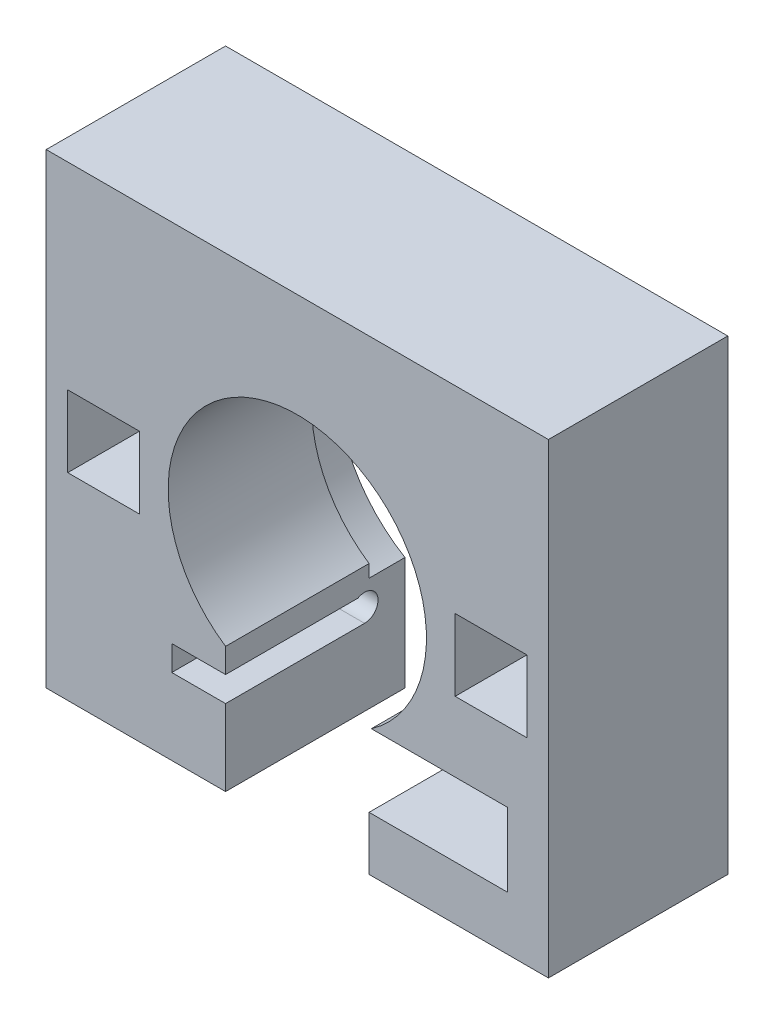
ISO-10303-21;
HEADER;
FILE_DESCRIPTION(('STEP AP214'),'2;1');
FILE_NAME('part.step','',(''),(''),'','','');
FILE_SCHEMA(('AUTOMOTIVE_DESIGN { 1 0 10303 214 1 1 1 1 }'));
ENDSEC;
DATA;
#1=APPLICATION_CONTEXT('core data for automotive mechanical design processes');
#2=APPLICATION_PROTOCOL_DEFINITION('international standard','automotive_design',2000,#1);
#3=PRODUCT_CONTEXT('',#1,'mechanical');
#4=PRODUCT('Part','Part','',(#3));
#5=PRODUCT_RELATED_PRODUCT_CATEGORY('part','',(#4));
#6=PRODUCT_DEFINITION_FORMATION('','',#4);
#7=PRODUCT_DEFINITION_CONTEXT('part definition',#1,'design');
#8=PRODUCT_DEFINITION('design','',#6,#7);
#9=PRODUCT_DEFINITION_SHAPE('','',#8);
#10=(LENGTH_UNIT() NAMED_UNIT(*) SI_UNIT(.MILLI.,.METRE.));
#11=(NAMED_UNIT(*) PLANE_ANGLE_UNIT() SI_UNIT($,.RADIAN.));
#12=(NAMED_UNIT(*) SI_UNIT($,.STERADIAN.) SOLID_ANGLE_UNIT());
#13=UNCERTAINTY_MEASURE_WITH_UNIT(LENGTH_MEASURE(1.E-05),#10,'distance_accuracy_value','');
#14=(GEOMETRIC_REPRESENTATION_CONTEXT(3) GLOBAL_UNCERTAINTY_ASSIGNED_CONTEXT((#13)) GLOBAL_UNIT_ASSIGNED_CONTEXT((#10,
#11,#12)) REPRESENTATION_CONTEXT('',''));
#15=CARTESIAN_POINT('',(0.,0.,0.));
#16=DIRECTION('',(0.,0.,1.));
#17=DIRECTION('',(1.,0.,0.));
#18=AXIS2_PLACEMENT_3D('',#15,#16,#17);
#19=CARTESIAN_POINT('',(38.2114604604618,-37.5541516245487,0.));
#20=DIRECTION('',(1.,0.,0.));
#21=DIRECTION('',(0.,0.,-1.));
#22=AXIS2_PLACEMENT_3D('',#19,#20,#21);
#23=PLANE('',#22);
#24=DIRECTION('',(0.,-1.,0.));
#25=VECTOR('',#24,1.);
#26=CARTESIAN_POINT('',(38.2114604604618,-37.5541516245487,9.));
#27=LINE('',#26,#25);
#28=CARTESIAN_POINT('',(38.2114604604618,-37.5541516245487,9.));
#29=VERTEX_POINT('',#28);
#30=CARTESIAN_POINT('',(38.2114604604618,-58.0541516245487,9.));
#31=VERTEX_POINT('',#30);
#32=EDGE_CURVE('E70',#29,#31,#27,.T.);
#33=ORIENTED_EDGE('',*,*,#32,.F.);
#34=DIRECTION('',(0.,0.,1.));
#35=VECTOR('',#34,1.);
#36=CARTESIAN_POINT('',(38.2114604604618,-37.5541516245487,0.));
#37=LINE('',#36,#35);
#38=CARTESIAN_POINT('',(38.2114604604618,-37.5541516245487,0.));
#39=VERTEX_POINT('',#38);
#40=EDGE_CURVE('E282',#39,#29,#37,.T.);
#41=ORIENTED_EDGE('',*,*,#40,.F.);
#42=DIRECTION('',(0.,1.,0.));
#43=VECTOR('',#42,1.);
#44=CARTESIAN_POINT('',(38.2114604604618,-37.5541516245487,0.));
#45=LINE('',#44,#43);
#46=CARTESIAN_POINT('',(38.2114604604618,-58.0541516245487,0.));
#47=VERTEX_POINT('',#46);
#48=EDGE_CURVE('E268',#47,#39,#45,.T.);
#49=ORIENTED_EDGE('',*,*,#48,.F.);
#50=DIRECTION('',(0.,0.,1.));
#51=VECTOR('',#50,1.);
#52=CARTESIAN_POINT('',(38.2114604604618,-58.0541516245487,0.));
#53=LINE('',#52,#51);
#54=EDGE_CURVE('E287',#47,#31,#53,.T.);
#55=ORIENTED_EDGE('',*,*,#54,.T.);
#56=EDGE_LOOP('',(#33,#41,#49,#55));
#57=FACE_BOUND('',#56,.T.);
#58=ADVANCED_FACE('F54',(#57),#23,.F.);
#59=CARTESIAN_POINT('',(0.,0.,50.));
#60=DIRECTION('',(0.,0.,1.));
#61=DIRECTION('',(1.,0.,0.));
#62=AXIS2_PLACEMENT_3D('',#59,#60,#61);
#63=PLANE('',#62);
#64=DIRECTION('',(-1.,0.,0.));
#65=VECTOR('',#64,1.);
#66=CARTESIAN_POINT('',(28.5614604604618,-37.5541516245487,50.));
#67=LINE('',#66,#65);
#68=CARTESIAN_POINT('',(67.2114604604619,-37.5541516245487,50.));
#69=VERTEX_POINT('',#68);
#70=CARTESIAN_POINT('',(29.1951707424252,-37.5541516245487,50.));
#71=VERTEX_POINT('',#70);
#72=EDGE_CURVE('E269',#69,#71,#67,.T.);
#73=ORIENTED_EDGE('',*,*,#72,.F.);
#74=DIRECTION('',(0.,1.,0.));
#75=VECTOR('',#74,1.);
#76=CARTESIAN_POINT('',(67.2114604604619,-37.5541516245487,50.));
#77=LINE('',#76,#75);
#78=CARTESIAN_POINT('',(67.2114604604619,-58.0541516245487,50.));
#79=VERTEX_POINT('',#78);
#80=EDGE_CURVE('E257',#79,#69,#77,.T.);
#81=ORIENTED_EDGE('',*,*,#80,.F.);
#82=DIRECTION('',(1.,0.,0.));
#83=VECTOR('',#82,1.);
#84=CARTESIAN_POINT('',(28.5614604604618,-58.0541516245487,50.));
#85=LINE('',#84,#83);
#86=CARTESIAN_POINT('',(28.5614604604618,-58.0541516245487,50.));
#87=VERTEX_POINT('',#86);
#88=EDGE_CURVE('E238',#87,#79,#85,.T.);
#89=ORIENTED_EDGE('',*,*,#88,.F.);
#90=DIRECTION('',(0.,-1.,0.));
#91=VECTOR('',#90,1.);
#92=CARTESIAN_POINT('',(28.5614604604618,56.9468483754513,50.));
#93=LINE('',#92,#91);
#94=CARTESIAN_POINT('',(28.5614604604618,-73.0541516245487,50.));
#95=VERTEX_POINT('',#94);
#96=EDGE_CURVE('E359',#87,#95,#93,.T.);
#97=ORIENTED_EDGE('',*,*,#96,.T.);
#98=DIRECTION('',(1.,0.,0.));
#99=VECTOR('',#98,1.);
#100=CARTESIAN_POINT('',(-61.4385395395382,-73.0541516245487,50.));
#101=LINE('',#100,#99);
#102=CARTESIAN_POINT('',(78.5614604604618,-73.0541516245487,50.));
#103=VERTEX_POINT('',#102);
#104=EDGE_CURVE('E474',#95,#103,#101,.T.);
#105=ORIENTED_EDGE('',*,*,#104,.T.);
#106=DIRECTION('',(0.,1.,0.));
#107=VECTOR('',#106,1.);
#108=CARTESIAN_POINT('',(78.5614604604618,56.9458483754513,50.));
#109=LINE('',#108,#107);
#110=CARTESIAN_POINT('',(78.5614604604618,56.9458483754513,50.));
#111=VERTEX_POINT('',#110);
#112=EDGE_CURVE('E480',#103,#111,#109,.T.);
#113=ORIENTED_EDGE('',*,*,#112,.T.);
#114=DIRECTION('',(-1.,0.,0.));
#115=VECTOR('',#114,1.);
#116=CARTESIAN_POINT('',(-61.4385395395382,56.9458483754513,50.));
#117=LINE('',#116,#115);
#118=CARTESIAN_POINT('',(-61.4385395395382,56.9458483754513,50.));
#119=VERTEX_POINT('',#118);
#120=EDGE_CURVE('E483',#111,#119,#117,.T.);
#121=ORIENTED_EDGE('',*,*,#120,.T.);
#122=DIRECTION('',(0.,-1.,0.));
#123=VECTOR('',#122,1.);
#124=CARTESIAN_POINT('',(-61.4385395395382,56.9458483754513,50.));
#125=LINE('',#124,#123);
#126=CARTESIAN_POINT('',(-61.4385395395382,-73.0541516245487,50.));
#127=VERTEX_POINT('',#126);
#128=EDGE_CURVE('E470',#119,#127,#125,.T.);
#129=ORIENTED_EDGE('',*,*,#128,.T.);
#130=CARTESIAN_POINT('',(-11.4385395395382,-73.0541516245487,50.));
#131=VERTEX_POINT('',#130);
#132=EDGE_CURVE('E476',#127,#131,#101,.T.);
#133=ORIENTED_EDGE('',*,*,#132,.T.);
#134=DIRECTION('',(0.,-1.,0.));
#135=VECTOR('',#134,1.);
#136=CARTESIAN_POINT('',(-11.4385395395382,56.9468483754513,50.));
#137=LINE('',#136,#135);
#138=CARTESIAN_POINT('',(-11.4385395395382,-51.8041516245487,50.));
#139=VERTEX_POINT('',#138);
#140=EDGE_CURVE('E358',#139,#131,#137,.T.);
#141=ORIENTED_EDGE('',*,*,#140,.F.);
#142=DIRECTION('',(1.,0.,0.));
#143=VECTOR('',#142,1.);
#144=CARTESIAN_POINT('',(-26.4385395395382,-51.8041516245487,50.));
#145=LINE('',#144,#143);
#146=CARTESIAN_POINT('',(-26.4385395395382,-51.8041516245487,50.));
#147=VERTEX_POINT('',#146);
#148=EDGE_CURVE('E324',#147,#139,#145,.T.);
#149=ORIENTED_EDGE('',*,*,#148,.F.);
#150=DIRECTION('',(0.,-1.,0.));
#151=VECTOR('',#150,1.);
#152=CARTESIAN_POINT('',(-26.4385395395382,0.,50.));
#153=LINE('',#152,#151);
#154=CARTESIAN_POINT('',(-26.4385395395382,-44.8041516245487,50.));
#155=VERTEX_POINT('',#154);
#156=EDGE_CURVE('E303',#155,#147,#153,.T.);
#157=ORIENTED_EDGE('',*,*,#156,.F.);
#158=DIRECTION('',(1.,0.,0.));
#159=VECTOR('',#158,1.);
#160=CARTESIAN_POINT('',(-26.4385395395382,-44.8041516245487,50.));
#161=LINE('',#160,#159);
#162=CARTESIAN_POINT('',(-11.4385395395382,-44.8041516245487,50.));
#163=VERTEX_POINT('',#162);
#164=EDGE_CURVE('E327',#155,#163,#161,.T.);
#165=ORIENTED_EDGE('',*,*,#164,.T.);
#166=CARTESIAN_POINT('',(-11.4385395395382,-37.9874107187403,50.));
#167=VERTEX_POINT('',#166);
#168=EDGE_CURVE('E352',#167,#163,#137,.T.);
#169=ORIENTED_EDGE('',*,*,#168,.F.);
#170=CARTESIAN_POINT('',(8.56146046046181,-8.05415162454874,50.));
#171=DIRECTION('',(0.,0.,1.));
#172=DIRECTION('',(1.,0.,0.));
#173=AXIS2_PLACEMENT_3D('',#170,#171,#172);
#174=CIRCLE('',#173,36.);
#175=EDGE_CURVE('E380',#71,#167,#174,.T.);
#176=ORIENTED_EDGE('',*,*,#175,.F.);
#177=EDGE_LOOP('',(#73,#81,#89,#97,#105,#113,#121,#129,#133,#141,#149,#157,#165,#169,#176));
#178=FACE_BOUND('',#177,.T.);
#179=DIRECTION('',(1.,0.,0.));
#180=VECTOR('',#179,1.);
#181=CARTESIAN_POINT('',(52.5614604604618,-18.0541516245487,50.));
#182=LINE('',#181,#180);
#183=CARTESIAN_POINT('',(52.5614604604618,-18.0541516245487,50.));
#184=VERTEX_POINT('',#183);
#185=CARTESIAN_POINT('',(72.5614604604618,-18.0541516245487,50.));
#186=VERTEX_POINT('',#185);
#187=EDGE_CURVE('E387',#184,#186,#182,.T.);
#188=ORIENTED_EDGE('',*,*,#187,.F.);
#189=DIRECTION('',(0.,-1.,0.));
#190=VECTOR('',#189,1.);
#191=CARTESIAN_POINT('',(52.5614604604618,1.94584837545127,50.));
#192=LINE('',#191,#190);
#193=CARTESIAN_POINT('',(52.5614604604618,1.94584837545127,50.));
#194=VERTEX_POINT('',#193);
#195=EDGE_CURVE('E384',#194,#184,#192,.T.);
#196=ORIENTED_EDGE('',*,*,#195,.F.);
#197=DIRECTION('',(-1.,0.,0.));
#198=VECTOR('',#197,1.);
#199=CARTESIAN_POINT('',(52.5614604604618,1.94584837545127,50.));
#200=LINE('',#199,#198);
#201=CARTESIAN_POINT('',(72.5614604604618,1.94584837545127,50.));
#202=VERTEX_POINT('',#201);
#203=EDGE_CURVE('E395',#202,#194,#200,.T.);
#204=ORIENTED_EDGE('',*,*,#203,.F.);
#205=DIRECTION('',(0.,1.,0.));
#206=VECTOR('',#205,1.);
#207=CARTESIAN_POINT('',(72.5614604604618,1.94584837545127,50.));
#208=LINE('',#207,#206);
#209=EDGE_CURVE('E391',#186,#202,#208,.T.);
#210=ORIENTED_EDGE('',*,*,#209,.F.);
#211=EDGE_LOOP('',(#188,#196,#204,#210));
#212=FACE_BOUND('',#211,.T.);
#213=DIRECTION('',(1.,0.,0.));
#214=VECTOR('',#213,1.);
#215=CARTESIAN_POINT('',(-55.4385395395382,-18.0541516245487,50.));
#216=LINE('',#215,#214);
#217=CARTESIAN_POINT('',(-55.4385395395382,-18.0541516245487,50.));
#218=VERTEX_POINT('',#217);
#219=CARTESIAN_POINT('',(-35.4385395395382,-18.0541516245487,50.));
#220=VERTEX_POINT('',#219);
#221=EDGE_CURVE('E430',#218,#220,#216,.T.);
#222=ORIENTED_EDGE('',*,*,#221,.F.);
#223=DIRECTION('',(0.,-1.,0.));
#224=VECTOR('',#223,1.);
#225=CARTESIAN_POINT('',(-55.4385395395382,1.94584837545127,50.));
#226=LINE('',#225,#224);
#227=CARTESIAN_POINT('',(-55.4385395395382,1.94584837545127,50.));
#228=VERTEX_POINT('',#227);
#229=EDGE_CURVE('E427',#228,#218,#226,.T.);
#230=ORIENTED_EDGE('',*,*,#229,.F.);
#231=DIRECTION('',(-1.,0.,0.));
#232=VECTOR('',#231,1.);
#233=CARTESIAN_POINT('',(-55.4385395395382,1.94584837545127,50.));
#234=LINE('',#233,#232);
#235=CARTESIAN_POINT('',(-35.4385395395382,1.94584837545127,50.));
#236=VERTEX_POINT('',#235);
#237=EDGE_CURVE('E438',#236,#228,#234,.T.);
#238=ORIENTED_EDGE('',*,*,#237,.F.);
#239=DIRECTION('',(0.,1.,0.));
#240=VECTOR('',#239,1.);
#241=CARTESIAN_POINT('',(-35.4385395395382,1.94584837545127,50.));
#242=LINE('',#241,#240);
#243=EDGE_CURVE('E434',#220,#236,#242,.T.);
#244=ORIENTED_EDGE('',*,*,#243,.F.);
#245=EDGE_LOOP('',(#222,#230,#238,#244));
#246=FACE_BOUND('',#245,.T.);
#247=ADVANCED_FACE('F552',(#178,#212,#246),#63,.T.);
#248=CARTESIAN_POINT('',(-11.4385395395382,56.9468483754513,50.));
#249=DIRECTION('',(-1.,0.,0.));
#250=DIRECTION('',(0.,0.,1.));
#251=AXIS2_PLACEMENT_3D('',#248,#249,#250);
#252=PLANE('',#251);
#253=DIRECTION('',(0.,0.,1.));
#254=VECTOR('',#253,1.);
#255=CARTESIAN_POINT('',(-11.4385395395381,-51.8041516245487,0.));
#256=LINE('',#255,#254);
#257=CARTESIAN_POINT('',(-11.4385395395381,-51.8041516245487,11.25));
#258=VERTEX_POINT('',#257);
#259=EDGE_CURVE('E304',#258,#139,#256,.T.);
#260=ORIENTED_EDGE('',*,*,#259,.T.);
#261=ORIENTED_EDGE('',*,*,#140,.T.);
#262=DIRECTION('',(0.,0.,-1.));
#263=VECTOR('',#262,1.);
#264=CARTESIAN_POINT('',(-11.4385395395382,-73.0541516245487,50.));
#265=LINE('',#264,#263);
#266=CARTESIAN_POINT('',(-11.4385395395381,-73.0541516245487,0.));
#267=VERTEX_POINT('',#266);
#268=EDGE_CURVE('E344',#131,#267,#265,.T.);
#269=ORIENTED_EDGE('',*,*,#268,.T.);
#270=DIRECTION('',(0.,-1.,0.));
#271=VECTOR('',#270,1.);
#272=CARTESIAN_POINT('',(-11.4385395395381,56.9468483754513,0.));
#273=LINE('',#272,#271);
#274=CARTESIAN_POINT('',(-11.4385395395381,-41.5354897101152,0.));
#275=VERTEX_POINT('',#274);
#276=EDGE_CURVE('E364',#275,#267,#273,.T.);
#277=ORIENTED_EDGE('',*,*,#276,.F.);
#278=DIRECTION('',(0.,0.,-1.));
#279=VECTOR('',#278,1.);
#280=CARTESIAN_POINT('',(-11.4385395395381,-41.5354897101152,10.));
#281=LINE('',#280,#279);
#282=CARTESIAN_POINT('',(-11.4385395395381,-41.5354897101152,10.));
#283=VERTEX_POINT('',#282);
#284=EDGE_CURVE('E323',#275,#283,#281,.F.);
#285=ORIENTED_EDGE('',*,*,#284,.T.);
#286=DIRECTION('',(0.,-1.,0.));
#287=VECTOR('',#286,1.);
#288=CARTESIAN_POINT('',(-11.4385395395381,56.9468483754513,10.));
#289=LINE('',#288,#287);
#290=CARTESIAN_POINT('',(-11.4385395395381,-37.9874107187403,10.));
#291=VERTEX_POINT('',#290);
#292=EDGE_CURVE('E351',#291,#283,#289,.T.);
#293=ORIENTED_EDGE('',*,*,#292,.F.);
#294=DIRECTION('',(0.,0.,-1.));
#295=VECTOR('',#294,1.);
#296=CARTESIAN_POINT('',(-11.4385395395382,-37.9874107187403,50.));
#297=LINE('',#296,#295);
#298=EDGE_CURVE('E347',#167,#291,#297,.T.);
#299=ORIENTED_EDGE('',*,*,#298,.F.);
#300=ORIENTED_EDGE('',*,*,#168,.T.);
#301=DIRECTION('',(0.,0.,1.));
#302=VECTOR('',#301,1.);
#303=CARTESIAN_POINT('',(-11.4385395395381,-44.8041516245487,0.));
#304=LINE('',#303,#302);
#305=CARTESIAN_POINT('',(-11.4385395395381,-44.8041516245487,13.120828693387));
#306=VERTEX_POINT('',#305);
#307=EDGE_CURVE('E312',#306,#163,#304,.T.);
#308=ORIENTED_EDGE('',*,*,#307,.F.);
#309=CARTESIAN_POINT('',(-11.4385395395381,-48.0541516245487,11.25));
#310=DIRECTION('',(1.,0.,0.));
#311=DIRECTION('',(0.,0.,-1.));
#312=AXIS2_PLACEMENT_3D('',#309,#310,#311);
#313=CIRCLE('',#312,3.75);
#314=EDGE_CURVE('E298',#258,#306,#313,.T.);
#315=ORIENTED_EDGE('',*,*,#314,.F.);
#316=EDGE_LOOP('',(#260,#261,#269,#277,#285,#293,#299,#300,#308,#315));
#317=FACE_BOUND('',#316,.T.);
#318=ADVANCED_FACE('F557',(#317),#252,.F.);
#319=CARTESIAN_POINT('',(-61.4385395395382,-73.0541516245487,50.));
#320=DIRECTION('',(0.,1.,0.));
#321=DIRECTION('',(0.,0.,1.));
#322=AXIS2_PLACEMENT_3D('',#319,#320,#321);
#323=PLANE('',#322);
#324=ORIENTED_EDGE('',*,*,#104,.F.);
#325=DIRECTION('',(0.,0.,1.));
#326=VECTOR('',#325,1.);
#327=CARTESIAN_POINT('',(28.5614604604618,-73.0541516245487,50.));
#328=LINE('',#327,#326);
#329=CARTESIAN_POINT('',(28.5614604604618,-73.0541516245487,0.));
#330=VERTEX_POINT('',#329);
#331=EDGE_CURVE('E339',#330,#95,#328,.T.);
#332=ORIENTED_EDGE('',*,*,#331,.F.);
#333=DIRECTION('',(1.,0.,0.));
#334=VECTOR('',#333,1.);
#335=CARTESIAN_POINT('',(-61.4385395395382,-73.0541516245487,0.));
#336=LINE('',#335,#334);
#337=CARTESIAN_POINT('',(78.5614604604618,-73.0541516245487,0.));
#338=VERTEX_POINT('',#337);
#339=EDGE_CURVE('E490',#330,#338,#336,.T.);
#340=ORIENTED_EDGE('',*,*,#339,.T.);
#341=DIRECTION('',(0.,0.,-1.));
#342=VECTOR('',#341,1.);
#343=CARTESIAN_POINT('',(78.5614604604618,-73.0541516245487,50.));
#344=LINE('',#343,#342);
#345=EDGE_CURVE('E507',#103,#338,#344,.T.);
#346=ORIENTED_EDGE('',*,*,#345,.F.);
#347=EDGE_LOOP('',(#324,#332,#340,#346));
#348=FACE_BOUND('',#347,.T.);
#349=ADVANCED_FACE('F546',(#348),#323,.F.);
#350=CARTESIAN_POINT('',(8.56146046046181,-8.05415162454874,50.));
#351=DIRECTION('',(0.,0.,-1.));
#352=DIRECTION('',(-1.,0.,0.));
#353=AXIS2_PLACEMENT_3D('',#350,#351,#352);
#354=CYLINDRICAL_SURFACE('',#353,36.);
#355=DIRECTION('',(0.,0.,-1.));
#356=VECTOR('',#355,1.);
#357=CARTESIAN_POINT('',(29.1951707424252,-37.5541516245487,50.));
#358=LINE('',#357,#356);
#359=CARTESIAN_POINT('',(29.1951707424252,-37.5541516245487,10.));
#360=VERTEX_POINT('',#359);
#361=EDGE_CURVE('E295',#71,#360,#358,.T.);
#362=ORIENTED_EDGE('',*,*,#361,.F.);
#363=ORIENTED_EDGE('',*,*,#175,.T.);
#364=ORIENTED_EDGE('',*,*,#298,.T.);
#365=CARTESIAN_POINT('',(8.56146046046181,-8.05415162454874,10.));
#366=DIRECTION('',(0.,0.,-1.));
#367=DIRECTION('',(-1.,0.,0.));
#368=AXIS2_PLACEMENT_3D('',#365,#366,#367);
#369=CIRCLE('',#368,36.);
#370=EDGE_CURVE('E376',#291,#360,#369,.T.);
#371=ORIENTED_EDGE('',*,*,#370,.T.);
#372=EDGE_LOOP('',(#362,#363,#364,#371));
#373=FACE_BOUND('',#372,.T.);
#374=ADVANCED_FACE('F518',(#373),#354,.F.);
#375=CARTESIAN_POINT('',(0.,0.,0.));
#376=DIRECTION('',(0.,0.,1.));
#377=DIRECTION('',(1.,0.,0.));
#378=AXIS2_PLACEMENT_3D('',#375,#376,#377);
#379=PLANE('',#378);
#380=ORIENTED_EDGE('',*,*,#48,.T.);
#381=DIRECTION('',(-1.,0.,0.));
#382=VECTOR('',#381,1.);
#383=CARTESIAN_POINT('',(28.5614604604618,-37.5541516245487,0.));
#384=LINE('',#383,#382);
#385=CARTESIAN_POINT('',(34.07126249811,-37.5541516245487,0.));
#386=VERTEX_POINT('',#385);
#387=EDGE_CURVE('E273',#39,#386,#384,.T.);
#388=ORIENTED_EDGE('',*,*,#387,.T.);
#389=CARTESIAN_POINT('',(8.56146046046181,-8.05415162454874,0.));
#390=DIRECTION('',(0.,0.,-1.));
#391=DIRECTION('',(-1.,0.,0.));
#392=AXIS2_PLACEMENT_3D('',#389,#390,#391);
#393=CIRCLE('',#392,39.);
#394=EDGE_CURVE('E368',#275,#386,#393,.T.);
#395=ORIENTED_EDGE('',*,*,#394,.F.);
#396=ORIENTED_EDGE('',*,*,#276,.T.);
#397=CARTESIAN_POINT('',(-61.4385395395382,-73.0541516245487,0.));
#398=VERTEX_POINT('',#397);
#399=EDGE_CURVE('E491',#398,#267,#336,.T.);
#400=ORIENTED_EDGE('',*,*,#399,.F.);
#401=DIRECTION('',(0.,-1.,0.));
#402=VECTOR('',#401,1.);
#403=CARTESIAN_POINT('',(-61.4385395395382,56.9458483754513,0.));
#404=LINE('',#403,#402);
#405=CARTESIAN_POINT('',(-61.4385395395382,56.9458483754513,0.));
#406=VERTEX_POINT('',#405);
#407=EDGE_CURVE('E469',#406,#398,#404,.T.);
#408=ORIENTED_EDGE('',*,*,#407,.F.);
#409=DIRECTION('',(-1.,0.,0.));
#410=VECTOR('',#409,1.);
#411=CARTESIAN_POINT('',(-61.4385395395382,56.9458483754513,0.));
#412=LINE('',#411,#410);
#413=CARTESIAN_POINT('',(78.5614604604618,56.9458483754513,0.));
#414=VERTEX_POINT('',#413);
#415=EDGE_CURVE('E475',#414,#406,#412,.T.);
#416=ORIENTED_EDGE('',*,*,#415,.F.);
#417=DIRECTION('',(0.,1.,0.));
#418=VECTOR('',#417,1.);
#419=CARTESIAN_POINT('',(78.5614604604618,56.9458483754513,0.));
#420=LINE('',#419,#418);
#421=EDGE_CURVE('E495',#338,#414,#420,.T.);
#422=ORIENTED_EDGE('',*,*,#421,.F.);
#423=ORIENTED_EDGE('',*,*,#339,.F.);
#424=DIRECTION('',(0.,-1.,0.));
#425=VECTOR('',#424,1.);
#426=CARTESIAN_POINT('',(28.5614604604618,56.9468483754513,0.));
#427=LINE('',#426,#425);
#428=CARTESIAN_POINT('',(28.5614604604618,-58.0541516245487,0.));
#429=VERTEX_POINT('',#428);
#430=EDGE_CURVE('E343',#429,#330,#427,.T.);
#431=ORIENTED_EDGE('',*,*,#430,.F.);
#432=DIRECTION('',(1.,0.,0.));
#433=VECTOR('',#432,1.);
#434=CARTESIAN_POINT('',(28.5614604604618,-58.0541516245487,0.));
#435=LINE('',#434,#433);
#436=EDGE_CURVE('E78',#429,#47,#435,.T.);
#437=ORIENTED_EDGE('',*,*,#436,.T.);
#438=EDGE_LOOP('',(#380,#388,#395,#396,#400,#408,#416,#422,#423,#431,#437));
#439=FACE_BOUND('',#438,.T.);
#440=DIRECTION('',(0.,-1.,0.));
#441=VECTOR('',#440,1.);
#442=CARTESIAN_POINT('',(-55.4385395395382,1.94584837545127,0.));
#443=LINE('',#442,#441);
#444=CARTESIAN_POINT('',(-55.4385395395382,1.94584837545127,0.));
#445=VERTEX_POINT('',#444);
#446=CARTESIAN_POINT('',(-55.4385395395382,-18.0541516245487,0.));
#447=VERTEX_POINT('',#446);
#448=EDGE_CURVE('E426',#445,#447,#443,.T.);
#449=ORIENTED_EDGE('',*,*,#448,.T.);
#450=DIRECTION('',(1.,0.,0.));
#451=VECTOR('',#450,1.);
#452=CARTESIAN_POINT('',(-55.4385395395382,-18.0541516245487,0.));
#453=LINE('',#452,#451);
#454=CARTESIAN_POINT('',(-35.4385395395382,-18.0541516245487,0.));
#455=VERTEX_POINT('',#454);
#456=EDGE_CURVE('E445',#447,#455,#453,.T.);
#457=ORIENTED_EDGE('',*,*,#456,.T.);
#458=DIRECTION('',(0.,1.,0.));
#459=VECTOR('',#458,1.);
#460=CARTESIAN_POINT('',(-35.4385395395382,1.94584837545127,0.));
#461=LINE('',#460,#459);
#462=CARTESIAN_POINT('',(-35.4385395395382,1.94584837545127,0.));
#463=VERTEX_POINT('',#462);
#464=EDGE_CURVE('E449',#455,#463,#461,.T.);
#465=ORIENTED_EDGE('',*,*,#464,.T.);
#466=DIRECTION('',(-1.,0.,0.));
#467=VECTOR('',#466,1.);
#468=CARTESIAN_POINT('',(-55.4385395395382,1.94584837545127,0.));
#469=LINE('',#468,#467);
#470=EDGE_CURVE('E431',#463,#445,#469,.T.);
#471=ORIENTED_EDGE('',*,*,#470,.T.);
#472=EDGE_LOOP('',(#449,#457,#465,#471));
#473=FACE_BOUND('',#472,.T.);
#474=DIRECTION('',(0.,-1.,0.));
#475=VECTOR('',#474,1.);
#476=CARTESIAN_POINT('',(52.5614604604618,1.94584837545127,0.));
#477=LINE('',#476,#475);
#478=CARTESIAN_POINT('',(52.5614604604618,1.94584837545127,0.));
#479=VERTEX_POINT('',#478);
#480=CARTESIAN_POINT('',(52.5614604604618,-18.0541516245487,0.));
#481=VERTEX_POINT('',#480);
#482=EDGE_CURVE('E383',#479,#481,#477,.T.);
#483=ORIENTED_EDGE('',*,*,#482,.T.);
#484=DIRECTION('',(1.,0.,0.));
#485=VECTOR('',#484,1.);
#486=CARTESIAN_POINT('',(52.5614604604618,-18.0541516245487,0.));
#487=LINE('',#486,#485);
#488=CARTESIAN_POINT('',(72.5614604604618,-18.0541516245487,0.));
#489=VERTEX_POINT('',#488);
#490=EDGE_CURVE('E402',#481,#489,#487,.T.);
#491=ORIENTED_EDGE('',*,*,#490,.T.);
#492=DIRECTION('',(0.,1.,0.));
#493=VECTOR('',#492,1.);
#494=CARTESIAN_POINT('',(72.5614604604618,1.94584837545127,0.));
#495=LINE('',#494,#493);
#496=CARTESIAN_POINT('',(72.5614604604618,1.94584837545127,0.));
#497=VERTEX_POINT('',#496);
#498=EDGE_CURVE('E406',#489,#497,#495,.T.);
#499=ORIENTED_EDGE('',*,*,#498,.T.);
#500=DIRECTION('',(-1.,0.,0.));
#501=VECTOR('',#500,1.);
#502=CARTESIAN_POINT('',(52.5614604604618,1.94584837545127,0.));
#503=LINE('',#502,#501);
#504=EDGE_CURVE('E388',#497,#479,#503,.T.);
#505=ORIENTED_EDGE('',*,*,#504,.T.);
#506=EDGE_LOOP('',(#483,#491,#499,#505));
#507=FACE_BOUND('',#506,.T.);
#508=ADVANCED_FACE('F533',(#439,#473,#507),#379,.F.);
#509=CARTESIAN_POINT('',(-61.4385395395382,56.9458483754513,50.));
#510=DIRECTION('',(1.,0.,0.));
#511=DIRECTION('',(0.,1.,0.));
#512=AXIS2_PLACEMENT_3D('',#509,#510,#511);
#513=PLANE('',#512);
#514=ORIENTED_EDGE('',*,*,#407,.T.);
#515=DIRECTION('',(0.,0.,-1.));
#516=VECTOR('',#515,1.);
#517=CARTESIAN_POINT('',(-61.4385395395382,-73.0541516245487,50.));
#518=LINE('',#517,#516);
#519=EDGE_CURVE('E63',#127,#398,#518,.T.);
#520=ORIENTED_EDGE('',*,*,#519,.F.);
#521=ORIENTED_EDGE('',*,*,#128,.F.);
#522=DIRECTION('',(0.,0.,-1.));
#523=VECTOR('',#522,1.);
#524=CARTESIAN_POINT('',(-61.4385395395382,56.9458483754513,50.));
#525=LINE('',#524,#523);
#526=EDGE_CURVE('E486',#119,#406,#525,.T.);
#527=ORIENTED_EDGE('',*,*,#526,.T.);
#528=EDGE_LOOP('',(#514,#520,#521,#527));
#529=FACE_BOUND('',#528,.T.);
#530=ADVANCED_FACE('F56',(#529),#513,.F.);
#531=ORIENTED_EDGE('',*,*,#399,.T.);
#532=ORIENTED_EDGE('',*,*,#268,.F.);
#533=ORIENTED_EDGE('',*,*,#132,.F.);
#534=ORIENTED_EDGE('',*,*,#519,.T.);
#535=EDGE_LOOP('',(#531,#532,#533,#534));
#536=FACE_BOUND('',#535,.T.);
#537=ADVANCED_FACE('F562',(#536),#323,.F.);
#538=CARTESIAN_POINT('',(78.5614604604618,56.9458483754513,50.));
#539=DIRECTION('',(-1.,0.,0.));
#540=DIRECTION('',(0.,-1.,0.));
#541=AXIS2_PLACEMENT_3D('',#538,#539,#540);
#542=PLANE('',#541);
#543=ORIENTED_EDGE('',*,*,#421,.T.);
#544=DIRECTION('',(0.,0.,-1.));
#545=VECTOR('',#544,1.);
#546=CARTESIAN_POINT('',(78.5614604604618,56.9458483754513,50.));
#547=LINE('',#546,#545);
#548=EDGE_CURVE('E503',#111,#414,#547,.T.);
#549=ORIENTED_EDGE('',*,*,#548,.F.);
#550=ORIENTED_EDGE('',*,*,#112,.F.);
#551=ORIENTED_EDGE('',*,*,#345,.T.);
#552=EDGE_LOOP('',(#543,#549,#550,#551));
#553=FACE_BOUND('',#552,.T.);
#554=ADVANCED_FACE('F574',(#553),#542,.F.);
#555=CARTESIAN_POINT('',(-61.4385395395382,56.9458483754513,50.));
#556=DIRECTION('',(0.,-1.,0.));
#557=DIRECTION('',(0.,0.,-1.));
#558=AXIS2_PLACEMENT_3D('',#555,#556,#557);
#559=PLANE('',#558);
#560=ORIENTED_EDGE('',*,*,#415,.T.);
#561=ORIENTED_EDGE('',*,*,#526,.F.);
#562=ORIENTED_EDGE('',*,*,#120,.F.);
#563=ORIENTED_EDGE('',*,*,#548,.T.);
#564=EDGE_LOOP('',(#560,#561,#562,#563));
#565=FACE_BOUND('',#564,.T.);
#566=ADVANCED_FACE('F572',(#565),#559,.F.);
#567=CARTESIAN_POINT('',(-55.4385395395382,1.94584837545127,50.));
#568=DIRECTION('',(1.,0.,0.));
#569=DIRECTION('',(0.,1.,0.));
#570=AXIS2_PLACEMENT_3D('',#567,#568,#569);
#571=PLANE('',#570);
#572=ORIENTED_EDGE('',*,*,#448,.F.);
#573=DIRECTION('',(0.,0.,-1.));
#574=VECTOR('',#573,1.);
#575=CARTESIAN_POINT('',(-55.4385395395382,1.94584837545127,50.));
#576=LINE('',#575,#574);
#577=EDGE_CURVE('E441',#228,#445,#576,.T.);
#578=ORIENTED_EDGE('',*,*,#577,.F.);
#579=ORIENTED_EDGE('',*,*,#229,.T.);
#580=DIRECTION('',(0.,0.,-1.));
#581=VECTOR('',#580,1.);
#582=CARTESIAN_POINT('',(-55.4385395395382,-18.0541516245487,50.));
#583=LINE('',#582,#581);
#584=EDGE_CURVE('E465',#218,#447,#583,.T.);
#585=ORIENTED_EDGE('',*,*,#584,.T.);
#586=EDGE_LOOP('',(#572,#578,#579,#585));
#587=FACE_BOUND('',#586,.T.);
#588=ADVANCED_FACE('F581',(#587),#571,.T.);
#589=CARTESIAN_POINT('',(-55.4385395395382,-18.0541516245487,50.));
#590=DIRECTION('',(0.,1.,0.));
#591=DIRECTION('',(0.,0.,1.));
#592=AXIS2_PLACEMENT_3D('',#589,#590,#591);
#593=PLANE('',#592);
#594=ORIENTED_EDGE('',*,*,#456,.F.);
#595=ORIENTED_EDGE('',*,*,#584,.F.);
#596=ORIENTED_EDGE('',*,*,#221,.T.);
#597=DIRECTION('',(0.,0.,-1.));
#598=VECTOR('',#597,1.);
#599=CARTESIAN_POINT('',(-35.4385395395382,-18.0541516245487,50.));
#600=LINE('',#599,#598);
#601=EDGE_CURVE('E462',#220,#455,#600,.T.);
#602=ORIENTED_EDGE('',*,*,#601,.T.);
#603=EDGE_LOOP('',(#594,#595,#596,#602));
#604=FACE_BOUND('',#603,.T.);
#605=ADVANCED_FACE('F643',(#604),#593,.T.);
#606=CARTESIAN_POINT('',(-35.4385395395382,1.94584837545127,50.));
#607=DIRECTION('',(-1.,0.,0.));
#608=DIRECTION('',(0.,0.,1.));
#609=AXIS2_PLACEMENT_3D('',#606,#607,#608);
#610=PLANE('',#609);
#611=ORIENTED_EDGE('',*,*,#464,.F.);
#612=ORIENTED_EDGE('',*,*,#601,.F.);
#613=ORIENTED_EDGE('',*,*,#243,.T.);
#614=DIRECTION('',(0.,0.,-1.));
#615=VECTOR('',#614,1.);
#616=CARTESIAN_POINT('',(-35.4385395395382,1.94584837545127,50.));
#617=LINE('',#616,#615);
#618=EDGE_CURVE('E459',#236,#463,#617,.T.);
#619=ORIENTED_EDGE('',*,*,#618,.T.);
#620=EDGE_LOOP('',(#611,#612,#613,#619));
#621=FACE_BOUND('',#620,.T.);
#622=ADVANCED_FACE('F639',(#621),#610,.T.);
#623=CARTESIAN_POINT('',(-55.4385395395382,1.94584837545127,50.));
#624=DIRECTION('',(0.,-1.,0.));
#625=DIRECTION('',(0.,0.,-1.));
#626=AXIS2_PLACEMENT_3D('',#623,#624,#625);
#627=PLANE('',#626);
#628=ORIENTED_EDGE('',*,*,#470,.F.);
#629=ORIENTED_EDGE('',*,*,#618,.F.);
#630=ORIENTED_EDGE('',*,*,#237,.T.);
#631=ORIENTED_EDGE('',*,*,#577,.T.);
#632=EDGE_LOOP('',(#628,#629,#630,#631));
#633=FACE_BOUND('',#632,.T.);
#634=ADVANCED_FACE('F635',(#633),#627,.T.);
#635=CARTESIAN_POINT('',(52.5614604604618,1.94584837545127,50.));
#636=DIRECTION('',(1.,0.,0.));
#637=DIRECTION('',(0.,0.,-1.));
#638=AXIS2_PLACEMENT_3D('',#635,#636,#637);
#639=PLANE('',#638);
#640=ORIENTED_EDGE('',*,*,#482,.F.);
#641=DIRECTION('',(0.,0.,-1.));
#642=VECTOR('',#641,1.);
#643=CARTESIAN_POINT('',(52.5614604604618,1.94584837545127,50.));
#644=LINE('',#643,#642);
#645=EDGE_CURVE('E398',#194,#479,#644,.T.);
#646=ORIENTED_EDGE('',*,*,#645,.F.);
#647=ORIENTED_EDGE('',*,*,#195,.T.);
#648=DIRECTION('',(0.,0.,-1.));
#649=VECTOR('',#648,1.);
#650=CARTESIAN_POINT('',(52.5614604604618,-18.0541516245487,50.));
#651=LINE('',#650,#649);
#652=EDGE_CURVE('E422',#184,#481,#651,.T.);
#653=ORIENTED_EDGE('',*,*,#652,.T.);
#654=EDGE_LOOP('',(#640,#646,#647,#653));
#655=FACE_BOUND('',#654,.T.);
#656=ADVANCED_FACE('F631',(#655),#639,.T.);
#657=CARTESIAN_POINT('',(52.5614604604618,-18.0541516245487,50.));
#658=DIRECTION('',(0.,1.,0.));
#659=DIRECTION('',(0.,0.,1.));
#660=AXIS2_PLACEMENT_3D('',#657,#658,#659);
#661=PLANE('',#660);
#662=ORIENTED_EDGE('',*,*,#490,.F.);
#663=ORIENTED_EDGE('',*,*,#652,.F.);
#664=ORIENTED_EDGE('',*,*,#187,.T.);
#665=DIRECTION('',(0.,0.,-1.));
#666=VECTOR('',#665,1.);
#667=CARTESIAN_POINT('',(72.5614604604618,-18.0541516245487,50.));
#668=LINE('',#667,#666);
#669=EDGE_CURVE('E419',#186,#489,#668,.T.);
#670=ORIENTED_EDGE('',*,*,#669,.T.);
#671=EDGE_LOOP('',(#662,#663,#664,#670));
#672=FACE_BOUND('',#671,.T.);
#673=ADVANCED_FACE('F627',(#672),#661,.T.);
#674=CARTESIAN_POINT('',(72.5614604604618,1.94584837545127,50.));
#675=DIRECTION('',(-1.,0.,0.));
#676=DIRECTION('',(0.,-1.,0.));
#677=AXIS2_PLACEMENT_3D('',#674,#675,#676);
#678=PLANE('',#677);
#679=ORIENTED_EDGE('',*,*,#498,.F.);
#680=ORIENTED_EDGE('',*,*,#669,.F.);
#681=ORIENTED_EDGE('',*,*,#209,.T.);
#682=DIRECTION('',(0.,0.,-1.));
#683=VECTOR('',#682,1.);
#684=CARTESIAN_POINT('',(72.5614604604618,1.94584837545127,50.));
#685=LINE('',#684,#683);
#686=EDGE_CURVE('E416',#202,#497,#685,.T.);
#687=ORIENTED_EDGE('',*,*,#686,.T.);
#688=EDGE_LOOP('',(#679,#680,#681,#687));
#689=FACE_BOUND('',#688,.T.);
#690=ADVANCED_FACE('F623',(#689),#678,.T.);
#691=CARTESIAN_POINT('',(52.5614604604618,1.94584837545127,50.));
#692=DIRECTION('',(0.,-1.,0.));
#693=DIRECTION('',(0.,0.,-1.));
#694=AXIS2_PLACEMENT_3D('',#691,#692,#693);
#695=PLANE('',#694);
#696=ORIENTED_EDGE('',*,*,#504,.F.);
#697=ORIENTED_EDGE('',*,*,#686,.F.);
#698=ORIENTED_EDGE('',*,*,#203,.T.);
#699=ORIENTED_EDGE('',*,*,#645,.T.);
#700=EDGE_LOOP('',(#696,#697,#698,#699));
#701=FACE_BOUND('',#700,.T.);
#702=ADVANCED_FACE('F618',(#701),#695,.T.);
#703=CARTESIAN_POINT('',(8.56146046046181,-8.05415162454874,10.));
#704=DIRECTION('',(0.,0.,-1.));
#705=DIRECTION('',(-1.,0.,0.));
#706=AXIS2_PLACEMENT_3D('',#703,#704,#705);
#707=CYLINDRICAL_SURFACE('',#706,39.);
#708=ORIENTED_EDGE('',*,*,#394,.T.);
#709=DIRECTION('',(0.,0.,-1.));
#710=VECTOR('',#709,1.);
#711=CARTESIAN_POINT('',(34.07126249811,-37.5541516245487,10.));
#712=LINE('',#711,#710);
#713=CARTESIAN_POINT('',(34.07126249811,-37.5541516245487,10.));
#714=VERTEX_POINT('',#713);
#715=EDGE_CURVE('E286',#386,#714,#712,.F.);
#716=ORIENTED_EDGE('',*,*,#715,.T.);
#717=CARTESIAN_POINT('',(8.56146046046181,-8.05415162454874,10.));
#718=DIRECTION('',(0.,0.,-1.));
#719=DIRECTION('',(-1.,0.,0.));
#720=AXIS2_PLACEMENT_3D('',#717,#718,#719);
#721=CIRCLE('',#720,39.);
#722=EDGE_CURVE('E372',#283,#714,#721,.T.);
#723=ORIENTED_EDGE('',*,*,#722,.F.);
#724=ORIENTED_EDGE('',*,*,#284,.F.);
#725=EDGE_LOOP('',(#708,#716,#723,#724));
#726=FACE_BOUND('',#725,.T.);
#727=ADVANCED_FACE('F529',(#726),#707,.F.);
#728=CARTESIAN_POINT('',(8.56146046046181,-8.05415162454874,10.));
#729=DIRECTION('',(0.,0.,-1.));
#730=DIRECTION('',(-1.,0.,0.));
#731=AXIS2_PLACEMENT_3D('',#728,#729,#730);
#732=PLANE('',#731);
#733=DIRECTION('',(1.,0.,0.));
#734=VECTOR('',#733,1.);
#735=CARTESIAN_POINT('',(8.56146046046181,-37.5541516245487,10.));
#736=LINE('',#735,#734);
#737=EDGE_CURVE('E12',#360,#714,#736,.T.);
#738=ORIENTED_EDGE('',*,*,#737,.F.);
#739=ORIENTED_EDGE('',*,*,#370,.F.);
#740=ORIENTED_EDGE('',*,*,#292,.T.);
#741=ORIENTED_EDGE('',*,*,#722,.T.);
#742=EDGE_LOOP('',(#738,#739,#740,#741));
#743=FACE_BOUND('',#742,.T.);
#744=ADVANCED_FACE('F523',(#743),#732,.T.);
#745=CARTESIAN_POINT('',(28.5614604604618,56.9468483754513,50.));
#746=DIRECTION('',(1.,0.,0.));
#747=DIRECTION('',(0.,0.,-1.));
#748=AXIS2_PLACEMENT_3D('',#745,#746,#747);
#749=PLANE('',#748);
#750=ORIENTED_EDGE('',*,*,#96,.F.);
#751=DIRECTION('',(0.,0.,1.));
#752=VECTOR('',#751,1.);
#753=CARTESIAN_POINT('',(28.5614604604618,-58.0541516245487,0.));
#754=LINE('',#753,#752);
#755=EDGE_CURVE('E277',#429,#87,#754,.T.);
#756=ORIENTED_EDGE('',*,*,#755,.F.);
#757=ORIENTED_EDGE('',*,*,#430,.T.);
#758=ORIENTED_EDGE('',*,*,#331,.T.);
#759=EDGE_LOOP('',(#750,#756,#757,#758));
#760=FACE_BOUND('',#759,.T.);
#761=ADVANCED_FACE('F543',(#760),#749,.F.);
#762=CARTESIAN_POINT('',(-26.4385395395381,-51.8041516245487,0.));
#763=DIRECTION('',(0.,1.,0.));
#764=DIRECTION('',(0.,0.,1.));
#765=AXIS2_PLACEMENT_3D('',#762,#763,#764);
#766=PLANE('',#765);
#767=ORIENTED_EDGE('',*,*,#259,.F.);
#768=DIRECTION('',(1.,0.,0.));
#769=VECTOR('',#768,1.);
#770=CARTESIAN_POINT('',(-26.4385395395381,-51.8041516245487,11.25));
#771=LINE('',#770,#769);
#772=CARTESIAN_POINT('',(-26.4385395395381,-51.8041516245487,11.25));
#773=VERTEX_POINT('',#772);
#774=EDGE_CURVE('E319',#773,#258,#771,.T.);
#775=ORIENTED_EDGE('',*,*,#774,.F.);
#776=DIRECTION('',(0.,0.,1.));
#777=VECTOR('',#776,1.);
#778=CARTESIAN_POINT('',(-26.4385395395381,-51.8041516245487,0.));
#779=LINE('',#778,#777);
#780=EDGE_CURVE('E308',#773,#147,#779,.T.);
#781=ORIENTED_EDGE('',*,*,#780,.T.);
#782=ORIENTED_EDGE('',*,*,#148,.T.);
#783=EDGE_LOOP('',(#767,#775,#781,#782));
#784=FACE_BOUND('',#783,.T.);
#785=ADVANCED_FACE('F600',(#784),#766,.T.);
#786=CARTESIAN_POINT('',(-26.4385395395381,-44.8041516245487,0.));
#787=DIRECTION('',(0.,1.,0.));
#788=DIRECTION('',(0.,0.,1.));
#789=AXIS2_PLACEMENT_3D('',#786,#787,#788);
#790=PLANE('',#789);
#791=ORIENTED_EDGE('',*,*,#307,.T.);
#792=ORIENTED_EDGE('',*,*,#164,.F.);
#793=DIRECTION('',(0.,0.,1.));
#794=VECTOR('',#793,1.);
#795=CARTESIAN_POINT('',(-26.4385395395381,-44.8041516245487,0.));
#796=LINE('',#795,#794);
#797=CARTESIAN_POINT('',(-26.4385395395381,-44.8041516245487,13.120828693387));
#798=VERTEX_POINT('',#797);
#799=EDGE_CURVE('E299',#798,#155,#796,.T.);
#800=ORIENTED_EDGE('',*,*,#799,.F.);
#801=DIRECTION('',(1.,0.,0.));
#802=VECTOR('',#801,1.);
#803=CARTESIAN_POINT('',(-26.4385395395381,-44.8041516245487,13.120828693387));
#804=LINE('',#803,#802);
#805=EDGE_CURVE('E311',#798,#306,#804,.T.);
#806=ORIENTED_EDGE('',*,*,#805,.T.);
#807=EDGE_LOOP('',(#791,#792,#800,#806));
#808=FACE_BOUND('',#807,.T.);
#809=ADVANCED_FACE('F598',(#808),#790,.F.);
#810=CARTESIAN_POINT('',(-26.4385395395381,0.,0.));
#811=DIRECTION('',(1.,0.,0.));
#812=DIRECTION('',(0.,0.,-1.));
#813=AXIS2_PLACEMENT_3D('',#810,#811,#812);
#814=PLANE('',#813);
#815=ORIENTED_EDGE('',*,*,#799,.T.);
#816=ORIENTED_EDGE('',*,*,#156,.T.);
#817=ORIENTED_EDGE('',*,*,#780,.F.);
#818=CARTESIAN_POINT('',(-26.4385395395381,-48.0541516245487,11.25));
#819=DIRECTION('',(1.,0.,0.));
#820=DIRECTION('',(0.,0.,-1.));
#821=AXIS2_PLACEMENT_3D('',#818,#819,#820);
#822=CIRCLE('',#821,3.75);
#823=EDGE_CURVE('E315',#773,#798,#822,.T.);
#824=ORIENTED_EDGE('',*,*,#823,.T.);
#825=EDGE_LOOP('',(#815,#816,#817,#824));
#826=FACE_BOUND('',#825,.T.);
#827=ADVANCED_FACE('F594',(#826),#814,.T.);
#828=CARTESIAN_POINT('',(-26.4385395395381,-48.0541516245487,11.25));
#829=DIRECTION('',(1.,0.,0.));
#830=DIRECTION('',(0.,0.,-1.));
#831=AXIS2_PLACEMENT_3D('',#828,#829,#830);
#832=CYLINDRICAL_SURFACE('',#831,3.75);
#833=ORIENTED_EDGE('',*,*,#774,.T.);
#834=ORIENTED_EDGE('',*,*,#314,.T.);
#835=ORIENTED_EDGE('',*,*,#805,.F.);
#836=ORIENTED_EDGE('',*,*,#823,.F.);
#837=EDGE_LOOP('',(#833,#834,#835,#836));
#838=FACE_BOUND('',#837,.T.);
#839=ADVANCED_FACE('F597',(#838),#832,.F.);
#840=CARTESIAN_POINT('',(28.5614604604618,-37.5541516245487,0.));
#841=DIRECTION('',(0.,1.,0.));
#842=DIRECTION('',(0.,0.,1.));
#843=AXIS2_PLACEMENT_3D('',#840,#841,#842);
#844=PLANE('',#843);
#845=ORIENTED_EDGE('',*,*,#361,.T.);
#846=ORIENTED_EDGE('',*,*,#737,.T.);
#847=ORIENTED_EDGE('',*,*,#715,.F.);
#848=ORIENTED_EDGE('',*,*,#387,.F.);
#849=ORIENTED_EDGE('',*,*,#40,.T.);
#850=DIRECTION('',(-1.,0.,0.));
#851=VECTOR('',#850,1.);
#852=CARTESIAN_POINT('',(38.2114604604618,-37.5541516245487,9.));
#853=LINE('',#852,#851);
#854=CARTESIAN_POINT('',(67.2114604604619,-37.5541516245487,9.));
#855=VERTEX_POINT('',#854);
#856=EDGE_CURVE('E244',#855,#29,#853,.T.);
#857=ORIENTED_EDGE('',*,*,#856,.F.);
#858=DIRECTION('',(0.,0.,1.));
#859=VECTOR('',#858,1.);
#860=CARTESIAN_POINT('',(67.2114604604619,-37.5541516245487,9.));
#861=LINE('',#860,#859);
#862=EDGE_CURVE('E243',#855,#69,#861,.T.);
#863=ORIENTED_EDGE('',*,*,#862,.T.);
#864=ORIENTED_EDGE('',*,*,#72,.T.);
#865=EDGE_LOOP('',(#845,#846,#847,#848,#849,#857,#863,#864));
#866=FACE_BOUND('',#865,.T.);
#867=ADVANCED_FACE('F526',(#866),#844,.F.);
#868=CARTESIAN_POINT('',(28.5614604604618,-58.0541516245487,0.));
#869=DIRECTION('',(0.,-1.,0.));
#870=DIRECTION('',(0.,0.,-1.));
#871=AXIS2_PLACEMENT_3D('',#868,#869,#870);
#872=PLANE('',#871);
#873=ORIENTED_EDGE('',*,*,#88,.T.);
#874=DIRECTION('',(0.,0.,1.));
#875=VECTOR('',#874,1.);
#876=CARTESIAN_POINT('',(67.2114604604619,-58.0541516245487,9.));
#877=LINE('',#876,#875);
#878=CARTESIAN_POINT('',(67.2114604604619,-58.0541516245487,9.));
#879=VERTEX_POINT('',#878);
#880=EDGE_CURVE('E232',#879,#79,#877,.T.);
#881=ORIENTED_EDGE('',*,*,#880,.F.);
#882=DIRECTION('',(1.,0.,0.));
#883=VECTOR('',#882,1.);
#884=CARTESIAN_POINT('',(38.2114604604618,-58.0541516245487,9.));
#885=LINE('',#884,#883);
#886=EDGE_CURVE('E235',#31,#879,#885,.T.);
#887=ORIENTED_EDGE('',*,*,#886,.F.);
#888=ORIENTED_EDGE('',*,*,#54,.F.);
#889=ORIENTED_EDGE('',*,*,#436,.F.);
#890=ORIENTED_EDGE('',*,*,#755,.T.);
#891=EDGE_LOOP('',(#873,#881,#887,#888,#889,#890));
#892=FACE_BOUND('',#891,.T.);
#893=ADVANCED_FACE('F234',(#892),#872,.F.);
#894=CARTESIAN_POINT('',(67.2114604604619,-37.5541516245487,9.));
#895=DIRECTION('',(1.,0.,0.));
#896=DIRECTION('',(0.,1.,0.));
#897=AXIS2_PLACEMENT_3D('',#894,#895,#896);
#898=PLANE('',#897);
#899=ORIENTED_EDGE('',*,*,#80,.T.);
#900=ORIENTED_EDGE('',*,*,#862,.F.);
#901=DIRECTION('',(0.,1.,0.));
#902=VECTOR('',#901,1.);
#903=CARTESIAN_POINT('',(67.2114604604619,-37.5541516245487,9.));
#904=LINE('',#903,#902);
#905=EDGE_CURVE('E247',#879,#855,#904,.T.);
#906=ORIENTED_EDGE('',*,*,#905,.F.);
#907=ORIENTED_EDGE('',*,*,#880,.T.);
#908=EDGE_LOOP('',(#899,#900,#906,#907));
#909=FACE_BOUND('',#908,.T.);
#910=ADVANCED_FACE('F248',(#909),#898,.F.);
#911=CARTESIAN_POINT('',(0.,0.,9.));
#912=DIRECTION('',(0.,0.,1.));
#913=DIRECTION('',(1.,0.,0.));
#914=AXIS2_PLACEMENT_3D('',#911,#912,#913);
#915=PLANE('',#914);
#916=ORIENTED_EDGE('',*,*,#32,.T.);
#917=ORIENTED_EDGE('',*,*,#886,.T.);
#918=ORIENTED_EDGE('',*,*,#905,.T.);
#919=ORIENTED_EDGE('',*,*,#856,.T.);
#920=EDGE_LOOP('',(#916,#917,#918,#919));
#921=FACE_BOUND('',#920,.T.);
#922=ADVANCED_FACE('F253',(#921),#915,.T.);
#923=CLOSED_SHELL('',(#58,#247,#318,#349,#374,#508,#530,#537,#554,#566,#588,#605,#622,#634,#656,
#673,#690,#702,#727,#744,#761,#785,#809,#827,#839,#867,#893,#910,#922));
#924=MANIFOLD_SOLID_BREP('B2',#923);
#925=ADVANCED_BREP_SHAPE_REPRESENTATION('',(#18,#924),#14);
#926=SHAPE_DEFINITION_REPRESENTATION(#9,#925);
ENDSEC;
END-ISO-10303-21;
